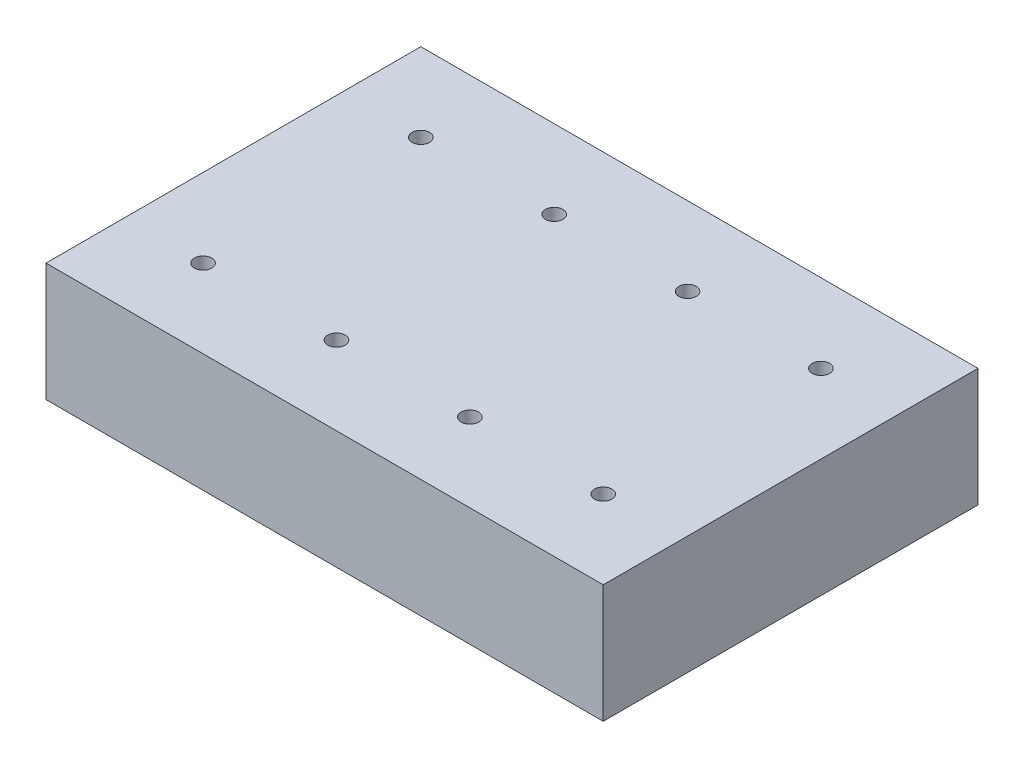
ISO-10303-21;
HEADER;
FILE_DESCRIPTION(('STEP AP214'),'2;1');
FILE_NAME('part.step','',(''),(''),'','','');
FILE_SCHEMA(('AUTOMOTIVE_DESIGN { 1 0 10303 214 1 1 1 1 }'));
ENDSEC;
DATA;
#1=APPLICATION_CONTEXT('core data for automotive mechanical design processes');
#2=APPLICATION_PROTOCOL_DEFINITION('international standard','automotive_design',2000,#1);
#3=PRODUCT_CONTEXT('',#1,'mechanical');
#4=PRODUCT('Part','Part','',(#3));
#5=PRODUCT_RELATED_PRODUCT_CATEGORY('part','',(#4));
#6=PRODUCT_DEFINITION_FORMATION('','',#4);
#7=PRODUCT_DEFINITION_CONTEXT('part definition',#1,'design');
#8=PRODUCT_DEFINITION('design','',#6,#7);
#9=PRODUCT_DEFINITION_SHAPE('','',#8);
#10=(LENGTH_UNIT() NAMED_UNIT(*) SI_UNIT(.MILLI.,.METRE.));
#11=(NAMED_UNIT(*) PLANE_ANGLE_UNIT() SI_UNIT($,.RADIAN.));
#12=(NAMED_UNIT(*) SI_UNIT($,.STERADIAN.) SOLID_ANGLE_UNIT());
#13=UNCERTAINTY_MEASURE_WITH_UNIT(LENGTH_MEASURE(1.E-05),#10,'distance_accuracy_value','');
#14=(GEOMETRIC_REPRESENTATION_CONTEXT(3) GLOBAL_UNCERTAINTY_ASSIGNED_CONTEXT((#13)) GLOBAL_UNIT_ASSIGNED_CONTEXT((#10,
#11,#12)) REPRESENTATION_CONTEXT('',''));
#15=CARTESIAN_POINT('',(0.,0.,0.));
#16=DIRECTION('',(0.,0.,1.));
#17=DIRECTION('',(1.,0.,0.));
#18=AXIS2_PLACEMENT_3D('',#15,#16,#17);
#19=CARTESIAN_POINT('',(-312.706003868978,28.1,-132.016665880732));
#20=DIRECTION('',(1.,0.,0.));
#21=DIRECTION('',(0.,0.,-1.));
#22=AXIS2_PLACEMENT_3D('',#19,#20,#21);
#23=PLANE('',#22);
#24=DIRECTION('',(0.,-1.,0.));
#25=VECTOR('',#24,1.);
#26=CARTESIAN_POINT('',(-312.706003868978,28.1,-132.016665880732));
#27=LINE('',#26,#25);
#28=CARTESIAN_POINT('',(-312.706003868978,28.1,-132.016665880732));
#29=VERTEX_POINT('',#28);
#30=CARTESIAN_POINT('',(-312.706003868978,1.,-132.016665880732));
#31=VERTEX_POINT('',#30);
#32=EDGE_CURVE('E315',#29,#31,#27,.T.);
#33=ORIENTED_EDGE('',*,*,#32,.T.);
#34=DIRECTION('',(0.,0.,1.));
#35=VECTOR('',#34,1.);
#36=CARTESIAN_POINT('',(-312.706003868978,1.,-132.016665880732));
#37=LINE('',#36,#35);
#38=CARTESIAN_POINT('',(-312.706003868978,1.,-46.1166658807324));
#39=VERTEX_POINT('',#38);
#40=EDGE_CURVE('E12',#31,#39,#37,.T.);
#41=ORIENTED_EDGE('',*,*,#40,.T.);
#42=DIRECTION('',(0.,-1.,0.));
#43=VECTOR('',#42,1.);
#44=CARTESIAN_POINT('',(-312.706003868978,28.1,-46.1166658807324));
#45=LINE('',#44,#43);
#46=CARTESIAN_POINT('',(-312.706003868978,28.1,-46.1166658807324));
#47=VERTEX_POINT('',#46);
#48=EDGE_CURVE('E152',#47,#39,#45,.T.);
#49=ORIENTED_EDGE('',*,*,#48,.F.);
#50=DIRECTION('',(0.,0.,1.));
#51=VECTOR('',#50,1.);
#52=CARTESIAN_POINT('',(-312.706003868978,28.1,-132.016665880732));
#53=LINE('',#52,#51);
#54=EDGE_CURVE('E158',#29,#47,#53,.T.);
#55=ORIENTED_EDGE('',*,*,#54,.F.);
#56=EDGE_LOOP('',(#33,#41,#49,#55));
#57=FACE_BOUND('',#56,.T.);
#58=ADVANCED_FACE('F95',(#57),#23,.F.);
#59=CARTESIAN_POINT('',(-312.706003868978,28.1,-46.1166658807324));
#60=DIRECTION('',(0.,0.,-1.));
#61=DIRECTION('',(-1.,0.,0.));
#62=AXIS2_PLACEMENT_3D('',#59,#60,#61);
#63=PLANE('',#62);
#64=ORIENTED_EDGE('',*,*,#48,.T.);
#65=DIRECTION('',(1.,0.,0.));
#66=VECTOR('',#65,1.);
#67=CARTESIAN_POINT('',(-312.706003868978,1.,-46.1166658807324));
#68=LINE('',#67,#66);
#69=CARTESIAN_POINT('',(-185.006003868978,1.,-46.1166658807324));
#70=VERTEX_POINT('',#69);
#71=EDGE_CURVE('E106',#39,#70,#68,.T.);
#72=ORIENTED_EDGE('',*,*,#71,.T.);
#73=DIRECTION('',(0.,-1.,0.));
#74=VECTOR('',#73,1.);
#75=CARTESIAN_POINT('',(-185.006003868978,28.1,-46.1166658807324));
#76=LINE('',#75,#74);
#77=CARTESIAN_POINT('',(-185.006003868978,28.1,-46.1166658807324));
#78=VERTEX_POINT('',#77);
#79=EDGE_CURVE('E153',#78,#70,#76,.T.);
#80=ORIENTED_EDGE('',*,*,#79,.F.);
#81=DIRECTION('',(1.,0.,0.));
#82=VECTOR('',#81,1.);
#83=CARTESIAN_POINT('',(-312.706003868978,28.1,-46.1166658807324));
#84=LINE('',#83,#82);
#85=EDGE_CURVE('E149',#47,#78,#84,.T.);
#86=ORIENTED_EDGE('',*,*,#85,.F.);
#87=EDGE_LOOP('',(#64,#72,#80,#86));
#88=FACE_BOUND('',#87,.T.);
#89=ADVANCED_FACE('F151',(#88),#63,.F.);
#90=CARTESIAN_POINT('',(-185.006003868978,28.1,-132.016665880732));
#91=DIRECTION('',(-1.,0.,0.));
#92=DIRECTION('',(0.,0.,1.));
#93=AXIS2_PLACEMENT_3D('',#90,#91,#92);
#94=PLANE('',#93);
#95=ORIENTED_EDGE('',*,*,#79,.T.);
#96=DIRECTION('',(0.,0.,-1.));
#97=VECTOR('',#96,1.);
#98=CARTESIAN_POINT('',(-185.006003868978,1.,-132.016665880732));
#99=LINE('',#98,#97);
#100=CARTESIAN_POINT('',(-185.006003868978,1.,-132.016665880732));
#101=VERTEX_POINT('',#100);
#102=EDGE_CURVE('E256',#70,#101,#99,.T.);
#103=ORIENTED_EDGE('',*,*,#102,.T.);
#104=DIRECTION('',(0.,-1.,0.));
#105=VECTOR('',#104,1.);
#106=CARTESIAN_POINT('',(-185.006003868978,28.1,-132.016665880732));
#107=LINE('',#106,#105);
#108=CARTESIAN_POINT('',(-185.006003868978,28.1,-132.016665880732));
#109=VERTEX_POINT('',#108);
#110=EDGE_CURVE('E176',#109,#101,#107,.T.);
#111=ORIENTED_EDGE('',*,*,#110,.F.);
#112=DIRECTION('',(0.,0.,-1.));
#113=VECTOR('',#112,1.);
#114=CARTESIAN_POINT('',(-185.006003868978,28.1,-132.016665880732));
#115=LINE('',#114,#113);
#116=EDGE_CURVE('E157',#78,#109,#115,.T.);
#117=ORIENTED_EDGE('',*,*,#116,.F.);
#118=EDGE_LOOP('',(#95,#103,#111,#117));
#119=FACE_BOUND('',#118,.T.);
#120=ADVANCED_FACE('F346',(#119),#94,.F.);
#121=CARTESIAN_POINT('',(-312.706003868978,28.1,-132.016665880732));
#122=DIRECTION('',(0.,0.,1.));
#123=DIRECTION('',(1.,0.,0.));
#124=AXIS2_PLACEMENT_3D('',#121,#122,#123);
#125=PLANE('',#124);
#126=ORIENTED_EDGE('',*,*,#110,.T.);
#127=DIRECTION('',(-1.,0.,0.));
#128=VECTOR('',#127,1.);
#129=CARTESIAN_POINT('',(-312.706003868978,1.,-132.016665880732));
#130=LINE('',#129,#128);
#131=EDGE_CURVE('E239',#101,#31,#130,.T.);
#132=ORIENTED_EDGE('',*,*,#131,.T.);
#133=ORIENTED_EDGE('',*,*,#32,.F.);
#134=DIRECTION('',(-1.,0.,0.));
#135=VECTOR('',#134,1.);
#136=CARTESIAN_POINT('',(-312.706003868978,28.1,-132.016665880732));
#137=LINE('',#136,#135);
#138=EDGE_CURVE('E163',#109,#29,#137,.T.);
#139=ORIENTED_EDGE('',*,*,#138,.F.);
#140=EDGE_LOOP('',(#126,#132,#133,#139));
#141=FACE_BOUND('',#140,.T.);
#142=ADVANCED_FACE('F322',(#141),#125,.F.);
#143=CARTESIAN_POINT('',(0.,28.1,0.));
#144=DIRECTION('',(0.,1.,0.));
#145=DIRECTION('',(0.,0.,1.));
#146=AXIS2_PLACEMENT_3D('',#143,#144,#145);
#147=PLANE('',#146);
#148=CARTESIAN_POINT('',(-294.706003868978,28.1,-114.016665880732));
#149=DIRECTION('',(0.,1.,0.));
#150=DIRECTION('',(0.,0.,1.));
#151=AXIS2_PLACEMENT_3D('',#148,#149,#150);
#152=CIRCLE('',#151,2.);
#153=CARTESIAN_POINT('',(-294.706003868978,28.1,-112.016665880732));
#154=VERTEX_POINT('',#153);
#155=EDGE_CURVE('E581',#154,#154,#152,.T.);
#156=ORIENTED_EDGE('',*,*,#155,.F.);
#157=EDGE_LOOP('',(#156));
#158=FACE_BOUND('',#157,.T.);
#159=CARTESIAN_POINT('',(-203.006003868978,28.1,-64.1166658807324));
#160=DIRECTION('',(0.,1.,0.));
#161=DIRECTION('',(0.,0.,1.));
#162=AXIS2_PLACEMENT_3D('',#159,#160,#161);
#163=CIRCLE('',#162,2.);
#164=CARTESIAN_POINT('',(-203.006003868978,28.1,-62.1166658807324));
#165=VERTEX_POINT('',#164);
#166=EDGE_CURVE('E561',#165,#165,#163,.T.);
#167=ORIENTED_EDGE('',*,*,#166,.F.);
#168=EDGE_LOOP('',(#167));
#169=FACE_BOUND('',#168,.T.);
#170=CARTESIAN_POINT('',(-233.566003868978,28.1,-64.1166658807324));
#171=DIRECTION('',(0.,1.,0.));
#172=DIRECTION('',(0.,0.,1.));
#173=AXIS2_PLACEMENT_3D('',#170,#171,#172);
#174=CIRCLE('',#173,2.);
#175=CARTESIAN_POINT('',(-233.566003868978,28.1,-62.1166658807324));
#176=VERTEX_POINT('',#175);
#177=EDGE_CURVE('E557',#176,#176,#174,.T.);
#178=ORIENTED_EDGE('',*,*,#177,.F.);
#179=EDGE_LOOP('',(#178));
#180=FACE_BOUND('',#179,.T.);
#181=CARTESIAN_POINT('',(-264.136003868978,28.1,-64.1166658807324));
#182=DIRECTION('',(0.,1.,0.));
#183=DIRECTION('',(0.,0.,1.));
#184=AXIS2_PLACEMENT_3D('',#181,#182,#183);
#185=CIRCLE('',#184,2.);
#186=CARTESIAN_POINT('',(-264.136003868978,28.1,-62.1166658807324));
#187=VERTEX_POINT('',#186);
#188=EDGE_CURVE('E265',#187,#187,#185,.T.);
#189=ORIENTED_EDGE('',*,*,#188,.F.);
#190=EDGE_LOOP('',(#189));
#191=FACE_BOUND('',#190,.T.);
#192=CARTESIAN_POINT('',(-264.136003868978,28.1,-114.016665880732));
#193=DIRECTION('',(0.,1.,0.));
#194=DIRECTION('',(0.,0.,1.));
#195=AXIS2_PLACEMENT_3D('',#192,#193,#194);
#196=CIRCLE('',#195,2.);
#197=CARTESIAN_POINT('',(-264.136003868978,28.1,-112.016665880732));
#198=VERTEX_POINT('',#197);
#199=EDGE_CURVE('E577',#198,#198,#196,.T.);
#200=ORIENTED_EDGE('',*,*,#199,.F.);
#201=EDGE_LOOP('',(#200));
#202=FACE_BOUND('',#201,.T.);
#203=CARTESIAN_POINT('',(-233.566003868978,28.1,-114.016665880732));
#204=DIRECTION('',(0.,1.,0.));
#205=DIRECTION('',(0.,0.,1.));
#206=AXIS2_PLACEMENT_3D('',#203,#204,#205);
#207=CIRCLE('',#206,2.);
#208=CARTESIAN_POINT('',(-233.566003868978,28.1,-112.016665880732));
#209=VERTEX_POINT('',#208);
#210=EDGE_CURVE('E569',#209,#209,#207,.T.);
#211=ORIENTED_EDGE('',*,*,#210,.F.);
#212=EDGE_LOOP('',(#211));
#213=FACE_BOUND('',#212,.T.);
#214=CARTESIAN_POINT('',(-203.006003868978,28.1,-114.016665880732));
#215=DIRECTION('',(0.,1.,0.));
#216=DIRECTION('',(0.,0.,1.));
#217=AXIS2_PLACEMENT_3D('',#214,#215,#216);
#218=CIRCLE('',#217,2.);
#219=CARTESIAN_POINT('',(-203.006003868978,28.1,-112.016665880732));
#220=VERTEX_POINT('',#219);
#221=EDGE_CURVE('E573',#220,#220,#218,.T.);
#222=ORIENTED_EDGE('',*,*,#221,.F.);
#223=EDGE_LOOP('',(#222));
#224=FACE_BOUND('',#223,.T.);
#225=CARTESIAN_POINT('',(-294.706003868978,28.1,-64.1166658807324));
#226=DIRECTION('',(0.,1.,0.));
#227=DIRECTION('',(0.,0.,1.));
#228=AXIS2_PLACEMENT_3D('',#225,#226,#227);
#229=CIRCLE('',#228,2.);
#230=CARTESIAN_POINT('',(-294.706003868978,28.1,-62.1166658807324));
#231=VERTEX_POINT('',#230);
#232=EDGE_CURVE('E565',#231,#231,#229,.T.);
#233=ORIENTED_EDGE('',*,*,#232,.F.);
#234=EDGE_LOOP('',(#233));
#235=FACE_BOUND('',#234,.T.);
#236=ORIENTED_EDGE('',*,*,#54,.T.);
#237=ORIENTED_EDGE('',*,*,#85,.T.);
#238=ORIENTED_EDGE('',*,*,#116,.T.);
#239=ORIENTED_EDGE('',*,*,#138,.T.);
#240=EDGE_LOOP('',(#236,#237,#238,#239));
#241=FACE_BOUND('',#240,.T.);
#242=ADVANCED_FACE('F161',(#158,#169,#180,#191,#202,#213,#224,#235,#241),#147,.T.);
#243=CARTESIAN_POINT('',(0.,0.,0.));
#244=DIRECTION('',(0.,1.,0.));
#245=DIRECTION('',(0.,0.,1.));
#246=AXIS2_PLACEMENT_3D('',#243,#244,#245);
#247=PLANE('',#246);
#248=DIRECTION('',(0.,0.,-1.));
#249=VECTOR('',#248,1.);
#250=CARTESIAN_POINT('',(-311.706003868978,0.,0.));
#251=LINE('',#250,#249);
#252=CARTESIAN_POINT('',(-311.706003868978,0.,-47.1166658807324));
#253=VERTEX_POINT('',#252);
#254=CARTESIAN_POINT('',(-311.706003868978,0.,-131.016665880732));
#255=VERTEX_POINT('',#254);
#256=EDGE_CURVE('E243',#253,#255,#251,.T.);
#257=ORIENTED_EDGE('',*,*,#256,.T.);
#258=DIRECTION('',(1.,0.,0.));
#259=VECTOR('',#258,1.);
#260=CARTESIAN_POINT('',(0.,0.,-131.016665880732));
#261=LINE('',#260,#259);
#262=CARTESIAN_POINT('',(-186.006003868978,0.,-131.016665880732));
#263=VERTEX_POINT('',#262);
#264=EDGE_CURVE('E252',#255,#263,#261,.T.);
#265=ORIENTED_EDGE('',*,*,#264,.T.);
#266=DIRECTION('',(0.,0.,1.));
#267=VECTOR('',#266,1.);
#268=CARTESIAN_POINT('',(-186.006003868977,0.,0.));
#269=LINE('',#268,#267);
#270=CARTESIAN_POINT('',(-186.006003868978,0.,-47.1166658807324));
#271=VERTEX_POINT('',#270);
#272=EDGE_CURVE('E249',#263,#271,#269,.T.);
#273=ORIENTED_EDGE('',*,*,#272,.T.);
#274=DIRECTION('',(-1.,0.,0.));
#275=VECTOR('',#274,1.);
#276=CARTESIAN_POINT('',(0.,0.,-47.1166658807323));
#277=LINE('',#276,#275);
#278=EDGE_CURVE('E246',#271,#253,#277,.T.);
#279=ORIENTED_EDGE('',*,*,#278,.T.);
#280=EDGE_LOOP('',(#257,#265,#273,#279));
#281=FACE_BOUND('',#280,.T.);
#282=CARTESIAN_POINT('',(-203.006003868978,0.,-114.016665880732));
#283=DIRECTION('',(0.,1.,0.));
#284=DIRECTION('',(0.,0.,1.));
#285=AXIS2_PLACEMENT_3D('',#282,#283,#284);
#286=CIRCLE('',#285,14.9);
#287=CARTESIAN_POINT('',(-203.006003868978,0.,-99.1166658807324));
#288=VERTEX_POINT('',#287);
#289=EDGE_CURVE('E223',#288,#288,#286,.T.);
#290=ORIENTED_EDGE('',*,*,#289,.T.);
#291=EDGE_LOOP('',(#290));
#292=FACE_BOUND('',#291,.T.);
#293=CARTESIAN_POINT('',(-233.566003868978,0.,-114.016665880732));
#294=DIRECTION('',(0.,1.,0.));
#295=DIRECTION('',(0.,0.,1.));
#296=AXIS2_PLACEMENT_3D('',#293,#294,#295);
#297=CIRCLE('',#296,14.9);
#298=CARTESIAN_POINT('',(-233.566003868978,0.,-99.1166658807324));
#299=VERTEX_POINT('',#298);
#300=EDGE_CURVE('E219',#299,#299,#297,.T.);
#301=ORIENTED_EDGE('',*,*,#300,.T.);
#302=EDGE_LOOP('',(#301));
#303=FACE_BOUND('',#302,.T.);
#304=CARTESIAN_POINT('',(-294.706003868978,0.,-114.016665880732));
#305=DIRECTION('',(0.,1.,0.));
#306=DIRECTION('',(0.,0.,1.));
#307=AXIS2_PLACEMENT_3D('',#304,#305,#306);
#308=CIRCLE('',#307,14.9);
#309=CARTESIAN_POINT('',(-294.706003868978,0.,-99.1166658807323));
#310=VERTEX_POINT('',#309);
#311=EDGE_CURVE('E215',#310,#310,#308,.T.);
#312=ORIENTED_EDGE('',*,*,#311,.T.);
#313=EDGE_LOOP('',(#312));
#314=FACE_BOUND('',#313,.T.);
#315=CARTESIAN_POINT('',(-264.136003868978,0.,-114.016665880732));
#316=DIRECTION('',(0.,1.,0.));
#317=DIRECTION('',(0.,0.,1.));
#318=AXIS2_PLACEMENT_3D('',#315,#316,#317);
#319=CIRCLE('',#318,14.9);
#320=CARTESIAN_POINT('',(-264.136003868978,0.,-99.1166658807324));
#321=VERTEX_POINT('',#320);
#322=EDGE_CURVE('E211',#321,#321,#319,.T.);
#323=ORIENTED_EDGE('',*,*,#322,.T.);
#324=EDGE_LOOP('',(#323));
#325=FACE_BOUND('',#324,.T.);
#326=CARTESIAN_POINT('',(-203.006003868978,0.,-64.1166658807324));
#327=DIRECTION('',(0.,1.,0.));
#328=DIRECTION('',(0.,0.,1.));
#329=AXIS2_PLACEMENT_3D('',#326,#327,#328);
#330=CIRCLE('',#329,14.9000000000001);
#331=CARTESIAN_POINT('',(-203.006003868978,0.,-49.2166658807323));
#332=VERTEX_POINT('',#331);
#333=EDGE_CURVE('E195',#332,#332,#330,.T.);
#334=ORIENTED_EDGE('',*,*,#333,.T.);
#335=EDGE_LOOP('',(#334));
#336=FACE_BOUND('',#335,.T.);
#337=CARTESIAN_POINT('',(-233.566003868978,0.,-64.1166658807324));
#338=DIRECTION('',(0.,1.,0.));
#339=DIRECTION('',(0.,0.,1.));
#340=AXIS2_PLACEMENT_3D('',#337,#338,#339);
#341=CIRCLE('',#340,14.9000000000001);
#342=CARTESIAN_POINT('',(-233.566003868978,0.,-49.2166658807323));
#343=VERTEX_POINT('',#342);
#344=EDGE_CURVE('E191',#343,#343,#341,.T.);
#345=ORIENTED_EDGE('',*,*,#344,.T.);
#346=EDGE_LOOP('',(#345));
#347=FACE_BOUND('',#346,.T.);
#348=CARTESIAN_POINT('',(-294.706003868978,0.,-64.1166658807324));
#349=DIRECTION('',(0.,1.,0.));
#350=DIRECTION('',(0.,0.,1.));
#351=AXIS2_PLACEMENT_3D('',#348,#349,#350);
#352=CIRCLE('',#351,14.9000000000001);
#353=CARTESIAN_POINT('',(-294.706003868978,0.,-49.2166658807323));
#354=VERTEX_POINT('',#353);
#355=EDGE_CURVE('E187',#354,#354,#352,.T.);
#356=ORIENTED_EDGE('',*,*,#355,.T.);
#357=EDGE_LOOP('',(#356));
#358=FACE_BOUND('',#357,.T.);
#359=CARTESIAN_POINT('',(-264.136003868978,0.,-64.1166658807324));
#360=DIRECTION('',(0.,1.,0.));
#361=DIRECTION('',(0.,0.,1.));
#362=AXIS2_PLACEMENT_3D('',#359,#360,#361);
#363=CIRCLE('',#362,14.9000000000001);
#364=CARTESIAN_POINT('',(-264.136003868978,0.,-49.2166658807323));
#365=VERTEX_POINT('',#364);
#366=EDGE_CURVE('E174',#365,#365,#363,.T.);
#367=ORIENTED_EDGE('',*,*,#366,.T.);
#368=EDGE_LOOP('',(#367));
#369=FACE_BOUND('',#368,.T.);
#370=ADVANCED_FACE('F484',(#281,#292,#303,#314,#325,#336,#347,#358,#369),#247,.F.);
#371=CARTESIAN_POINT('',(-264.136003868978,25.,-64.1166658807324));
#372=DIRECTION('',(0.,-1.,0.));
#373=DIRECTION('',(0.,0.,-1.));
#374=AXIS2_PLACEMENT_3D('',#371,#372,#373);
#375=CYLINDRICAL_SURFACE('',#374,13.9);
#376=CARTESIAN_POINT('',(-264.136003868978,1.00000000000004,-64.1166658807324));
#377=DIRECTION('',(0.,1.,0.));
#378=DIRECTION('',(0.,0.,1.));
#379=AXIS2_PLACEMENT_3D('',#376,#377,#378);
#380=CIRCLE('',#379,13.9);
#381=CARTESIAN_POINT('',(-264.136003868978,1.00000000000004,-50.2166658807323));
#382=VERTEX_POINT('',#381);
#383=EDGE_CURVE('E169',#382,#382,#380,.F.);
#384=ORIENTED_EDGE('',*,*,#383,.T.);
#385=EDGE_LOOP('',(#384));
#386=FACE_BOUND('',#385,.T.);
#387=CARTESIAN_POINT('',(-264.136003868978,25.,-64.1166658807324));
#388=DIRECTION('',(0.,-1.,0.));
#389=DIRECTION('',(0.,0.,-1.));
#390=AXIS2_PLACEMENT_3D('',#387,#388,#389);
#391=CIRCLE('',#390,13.9);
#392=CARTESIAN_POINT('',(-264.136003868978,25.,-78.0166658807324));
#393=VERTEX_POINT('',#392);
#394=EDGE_CURVE('E296',#393,#393,#391,.T.);
#395=ORIENTED_EDGE('',*,*,#394,.F.);
#396=EDGE_LOOP('',(#395));
#397=FACE_BOUND('',#396,.T.);
#398=ADVANCED_FACE('F481',(#386,#397),#375,.F.);
#399=CARTESIAN_POINT('',(-264.136003868978,25.,-64.1166658807324));
#400=DIRECTION('',(0.,-1.,0.));
#401=DIRECTION('',(0.,0.,-1.));
#402=AXIS2_PLACEMENT_3D('',#399,#400,#401);
#403=PLANE('',#402);
#404=CARTESIAN_POINT('',(-264.136003868978,25.,-64.1166658807324));
#405=DIRECTION('',(0.,-1.,0.));
#406=DIRECTION('',(0.,0.,-1.));
#407=AXIS2_PLACEMENT_3D('',#404,#405,#406);
#408=CIRCLE('',#407,2.);
#409=CARTESIAN_POINT('',(-264.136003868978,25.,-66.1166658807324));
#410=VERTEX_POINT('',#409);
#411=EDGE_CURVE('E589',#410,#410,#408,.T.);
#412=ORIENTED_EDGE('',*,*,#411,.F.);
#413=EDGE_LOOP('',(#412));
#414=FACE_BOUND('',#413,.T.);
#415=ORIENTED_EDGE('',*,*,#394,.T.);
#416=EDGE_LOOP('',(#415));
#417=FACE_BOUND('',#416,.T.);
#418=ADVANCED_FACE('F476',(#414,#417),#403,.T.);
#419=CARTESIAN_POINT('',(-233.566003868978,25.,-64.1166658807324));
#420=DIRECTION('',(0.,-1.,0.));
#421=DIRECTION('',(0.,0.,-1.));
#422=AXIS2_PLACEMENT_3D('',#419,#420,#421);
#423=CYLINDRICAL_SURFACE('',#422,13.9);
#424=CARTESIAN_POINT('',(-233.566003868978,1.00000000000004,-64.1166658807324));
#425=DIRECTION('',(0.,1.,0.));
#426=DIRECTION('',(0.,0.,1.));
#427=AXIS2_PLACEMENT_3D('',#424,#425,#426);
#428=CIRCLE('',#427,13.9);
#429=CARTESIAN_POINT('',(-233.566003868978,1.00000000000004,-50.2166658807323));
#430=VERTEX_POINT('',#429);
#431=EDGE_CURVE('E199',#430,#430,#428,.F.);
#432=ORIENTED_EDGE('',*,*,#431,.T.);
#433=EDGE_LOOP('',(#432));
#434=FACE_BOUND('',#433,.T.);
#435=CARTESIAN_POINT('',(-233.566003868978,25.,-64.1166658807324));
#436=DIRECTION('',(0.,-1.,0.));
#437=DIRECTION('',(0.,0.,-1.));
#438=AXIS2_PLACEMENT_3D('',#435,#436,#437);
#439=CIRCLE('',#438,13.9);
#440=CARTESIAN_POINT('',(-233.566003868978,25.,-78.0166658807324));
#441=VERTEX_POINT('',#440);
#442=EDGE_CURVE('E304',#441,#441,#439,.T.);
#443=ORIENTED_EDGE('',*,*,#442,.F.);
#444=EDGE_LOOP('',(#443));
#445=FACE_BOUND('',#444,.T.);
#446=ADVANCED_FACE('F473',(#434,#445),#423,.F.);
#447=CARTESIAN_POINT('',(-233.566003868978,25.,-64.1166658807324));
#448=DIRECTION('',(0.,-1.,0.));
#449=DIRECTION('',(0.,0.,-1.));
#450=AXIS2_PLACEMENT_3D('',#447,#448,#449);
#451=PLANE('',#450);
#452=CARTESIAN_POINT('',(-233.566003868978,25.,-64.1166658807324));
#453=DIRECTION('',(0.,-1.,0.));
#454=DIRECTION('',(0.,0.,-1.));
#455=AXIS2_PLACEMENT_3D('',#452,#453,#454);
#456=CIRCLE('',#455,2.);
#457=CARTESIAN_POINT('',(-233.566003868978,25.,-66.1166658807324));
#458=VERTEX_POINT('',#457);
#459=EDGE_CURVE('E590',#458,#458,#456,.T.);
#460=ORIENTED_EDGE('',*,*,#459,.F.);
#461=EDGE_LOOP('',(#460));
#462=FACE_BOUND('',#461,.T.);
#463=ORIENTED_EDGE('',*,*,#442,.T.);
#464=EDGE_LOOP('',(#463));
#465=FACE_BOUND('',#464,.T.);
#466=ADVANCED_FACE('F468',(#462,#465),#451,.T.);
#467=CARTESIAN_POINT('',(-203.006003868978,25.,-64.1166658807324));
#468=DIRECTION('',(0.,-1.,0.));
#469=DIRECTION('',(0.,0.,-1.));
#470=AXIS2_PLACEMENT_3D('',#467,#468,#469);
#471=CYLINDRICAL_SURFACE('',#470,13.9);
#472=CARTESIAN_POINT('',(-203.006003868978,1.00000000000004,-64.1166658807324));
#473=DIRECTION('',(0.,1.,0.));
#474=DIRECTION('',(0.,0.,1.));
#475=AXIS2_PLACEMENT_3D('',#472,#473,#474);
#476=CIRCLE('',#475,13.9);
#477=CARTESIAN_POINT('',(-203.006003868978,1.00000000000004,-50.2166658807323));
#478=VERTEX_POINT('',#477);
#479=EDGE_CURVE('E183',#478,#478,#476,.F.);
#480=ORIENTED_EDGE('',*,*,#479,.T.);
#481=EDGE_LOOP('',(#480));
#482=FACE_BOUND('',#481,.T.);
#483=CARTESIAN_POINT('',(-203.006003868978,25.,-64.1166658807324));
#484=DIRECTION('',(0.,-1.,0.));
#485=DIRECTION('',(0.,0.,-1.));
#486=AXIS2_PLACEMENT_3D('',#483,#484,#485);
#487=CIRCLE('',#486,13.9);
#488=CARTESIAN_POINT('',(-203.006003868978,25.,-78.0166658807324));
#489=VERTEX_POINT('',#488);
#490=EDGE_CURVE('E300',#489,#489,#487,.T.);
#491=ORIENTED_EDGE('',*,*,#490,.F.);
#492=EDGE_LOOP('',(#491));
#493=FACE_BOUND('',#492,.T.);
#494=ADVANCED_FACE('F465',(#482,#493),#471,.F.);
#495=CARTESIAN_POINT('',(-203.006003868978,25.,-64.1166658807324));
#496=DIRECTION('',(0.,-1.,0.));
#497=DIRECTION('',(0.,0.,-1.));
#498=AXIS2_PLACEMENT_3D('',#495,#496,#497);
#499=PLANE('',#498);
#500=CARTESIAN_POINT('',(-203.006003868978,25.,-64.1166658807324));
#501=DIRECTION('',(0.,-1.,0.));
#502=DIRECTION('',(0.,0.,-1.));
#503=AXIS2_PLACEMENT_3D('',#500,#501,#502);
#504=CIRCLE('',#503,2.);
#505=CARTESIAN_POINT('',(-203.006003868978,25.,-66.1166658807324));
#506=VERTEX_POINT('',#505);
#507=EDGE_CURVE('E594',#506,#506,#504,.T.);
#508=ORIENTED_EDGE('',*,*,#507,.F.);
#509=EDGE_LOOP('',(#508));
#510=FACE_BOUND('',#509,.T.);
#511=ORIENTED_EDGE('',*,*,#490,.T.);
#512=EDGE_LOOP('',(#511));
#513=FACE_BOUND('',#512,.T.);
#514=ADVANCED_FACE('F463',(#510,#513),#499,.T.);
#515=CARTESIAN_POINT('',(-294.706003868978,25.,-64.1166658807324));
#516=DIRECTION('',(0.,-1.,0.));
#517=DIRECTION('',(0.,0.,-1.));
#518=AXIS2_PLACEMENT_3D('',#515,#516,#517);
#519=CYLINDRICAL_SURFACE('',#518,13.9);
#520=CARTESIAN_POINT('',(-294.706003868978,1.00000000000004,-64.1166658807324));
#521=DIRECTION('',(0.,1.,0.));
#522=DIRECTION('',(0.,0.,1.));
#523=AXIS2_PLACEMENT_3D('',#520,#521,#522);
#524=CIRCLE('',#523,13.9);
#525=CARTESIAN_POINT('',(-294.706003868978,1.00000000000004,-50.2166658807323));
#526=VERTEX_POINT('',#525);
#527=EDGE_CURVE('E203',#526,#526,#524,.F.);
#528=ORIENTED_EDGE('',*,*,#527,.T.);
#529=EDGE_LOOP('',(#528));
#530=FACE_BOUND('',#529,.T.);
#531=CARTESIAN_POINT('',(-294.706003868978,25.,-64.1166658807324));
#532=DIRECTION('',(0.,-1.,0.));
#533=DIRECTION('',(0.,0.,-1.));
#534=AXIS2_PLACEMENT_3D('',#531,#532,#533);
#535=CIRCLE('',#534,13.9);
#536=CARTESIAN_POINT('',(-294.706003868978,25.,-78.0166658807324));
#537=VERTEX_POINT('',#536);
#538=EDGE_CURVE('E166',#537,#537,#535,.T.);
#539=ORIENTED_EDGE('',*,*,#538,.F.);
#540=EDGE_LOOP('',(#539));
#541=FACE_BOUND('',#540,.T.);
#542=ADVANCED_FACE('F459',(#530,#541),#519,.F.);
#543=CARTESIAN_POINT('',(-294.706003868978,25.,-64.1166658807324));
#544=DIRECTION('',(0.,-1.,0.));
#545=DIRECTION('',(0.,0.,-1.));
#546=AXIS2_PLACEMENT_3D('',#543,#544,#545);
#547=PLANE('',#546);
#548=CARTESIAN_POINT('',(-294.706003868978,25.,-64.1166658807324));
#549=DIRECTION('',(0.,-1.,0.));
#550=DIRECTION('',(0.,0.,-1.));
#551=AXIS2_PLACEMENT_3D('',#548,#549,#550);
#552=CIRCLE('',#551,2.);
#553=CARTESIAN_POINT('',(-294.706003868978,25.,-66.1166658807324));
#554=VERTEX_POINT('',#553);
#555=EDGE_CURVE('E585',#554,#554,#552,.T.);
#556=ORIENTED_EDGE('',*,*,#555,.F.);
#557=EDGE_LOOP('',(#556));
#558=FACE_BOUND('',#557,.T.);
#559=ORIENTED_EDGE('',*,*,#538,.T.);
#560=EDGE_LOOP('',(#559));
#561=FACE_BOUND('',#560,.T.);
#562=ADVANCED_FACE('F358',(#558,#561),#547,.T.);
#563=CARTESIAN_POINT('',(-264.136003868978,1.00000000000004,-64.1166658807324));
#564=DIRECTION('',(0.,-1.,0.));
#565=DIRECTION('',(0.,0.,-1.));
#566=AXIS2_PLACEMENT_3D('',#563,#564,#565);
#567=CONICAL_SURFACE('',#566,13.9,0.785398163397438);
#568=ORIENTED_EDGE('',*,*,#366,.F.);
#569=EDGE_LOOP('',(#568));
#570=FACE_BOUND('',#569,.T.);
#571=ORIENTED_EDGE('',*,*,#383,.F.);
#572=EDGE_LOOP('',(#571));
#573=FACE_BOUND('',#572,.T.);
#574=ADVANCED_FACE('F351',(#570,#573),#567,.F.);
#575=CARTESIAN_POINT('',(-203.006003868978,1.00000000000004,-64.1166658807324));
#576=DIRECTION('',(0.,-1.,0.));
#577=DIRECTION('',(0.,0.,-1.));
#578=AXIS2_PLACEMENT_3D('',#575,#576,#577);
#579=CONICAL_SURFACE('',#578,13.9,0.785398163397438);
#580=ORIENTED_EDGE('',*,*,#333,.F.);
#581=EDGE_LOOP('',(#580));
#582=FACE_BOUND('',#581,.T.);
#583=ORIENTED_EDGE('',*,*,#479,.F.);
#584=EDGE_LOOP('',(#583));
#585=FACE_BOUND('',#584,.T.);
#586=ADVANCED_FACE('F357',(#582,#585),#579,.F.);
#587=CARTESIAN_POINT('',(-233.566003868978,1.00000000000004,-64.1166658807324));
#588=DIRECTION('',(0.,-1.,0.));
#589=DIRECTION('',(0.,0.,-1.));
#590=AXIS2_PLACEMENT_3D('',#587,#588,#589);
#591=CONICAL_SURFACE('',#590,13.9,0.785398163397438);
#592=ORIENTED_EDGE('',*,*,#344,.F.);
#593=EDGE_LOOP('',(#592));
#594=FACE_BOUND('',#593,.T.);
#595=ORIENTED_EDGE('',*,*,#431,.F.);
#596=EDGE_LOOP('',(#595));
#597=FACE_BOUND('',#596,.T.);
#598=ADVANCED_FACE('F365',(#594,#597),#591,.F.);
#599=CARTESIAN_POINT('',(-294.706003868978,1.00000000000004,-64.1166658807324));
#600=DIRECTION('',(0.,-1.,0.));
#601=DIRECTION('',(0.,0.,-1.));
#602=AXIS2_PLACEMENT_3D('',#599,#600,#601);
#603=CONICAL_SURFACE('',#602,13.9,0.785398163397438);
#604=ORIENTED_EDGE('',*,*,#355,.F.);
#605=EDGE_LOOP('',(#604));
#606=FACE_BOUND('',#605,.T.);
#607=ORIENTED_EDGE('',*,*,#527,.F.);
#608=EDGE_LOOP('',(#607));
#609=FACE_BOUND('',#608,.T.);
#610=ADVANCED_FACE('F372',(#606,#609),#603,.F.);
#611=CARTESIAN_POINT('',(-233.566003868978,25.,-114.016665880732));
#612=DIRECTION('',(0.,-1.,0.));
#613=DIRECTION('',(0.,0.,-1.));
#614=AXIS2_PLACEMENT_3D('',#611,#612,#613);
#615=CYLINDRICAL_SURFACE('',#614,13.9);
#616=CARTESIAN_POINT('',(-233.566003868978,1.00000000000004,-114.016665880732));
#617=DIRECTION('',(0.,1.,0.));
#618=DIRECTION('',(0.,0.,1.));
#619=AXIS2_PLACEMENT_3D('',#616,#617,#618);
#620=CIRCLE('',#619,13.9);
#621=CARTESIAN_POINT('',(-233.566003868978,1.00000000000004,-100.116665880732));
#622=VERTEX_POINT('',#621);
#623=EDGE_CURVE('E227',#622,#622,#620,.F.);
#624=ORIENTED_EDGE('',*,*,#623,.T.);
#625=EDGE_LOOP('',(#624));
#626=FACE_BOUND('',#625,.T.);
#627=CARTESIAN_POINT('',(-233.566003868978,25.,-114.016665880732));
#628=DIRECTION('',(0.,-1.,0.));
#629=DIRECTION('',(0.,0.,-1.));
#630=AXIS2_PLACEMENT_3D('',#627,#628,#629);
#631=CIRCLE('',#630,13.9);
#632=CARTESIAN_POINT('',(-233.566003868978,25.,-127.916665880732));
#633=VERTEX_POINT('',#632);
#634=EDGE_CURVE('E292',#633,#633,#631,.T.);
#635=ORIENTED_EDGE('',*,*,#634,.F.);
#636=EDGE_LOOP('',(#635));
#637=FACE_BOUND('',#636,.T.);
#638=ADVANCED_FACE('F379',(#626,#637),#615,.F.);
#639=CARTESIAN_POINT('',(-233.566003868978,25.,-114.016665880732));
#640=DIRECTION('',(0.,-1.,0.));
#641=DIRECTION('',(0.,0.,-1.));
#642=AXIS2_PLACEMENT_3D('',#639,#640,#641);
#643=PLANE('',#642);
#644=CARTESIAN_POINT('',(-233.566003868978,25.,-114.016665880732));
#645=DIRECTION('',(0.,-1.,0.));
#646=DIRECTION('',(0.,0.,-1.));
#647=AXIS2_PLACEMENT_3D('',#644,#645,#646);
#648=CIRCLE('',#647,2.);
#649=CARTESIAN_POINT('',(-233.566003868978,25.,-116.016665880732));
#650=VERTEX_POINT('',#649);
#651=EDGE_CURVE('E610',#650,#650,#648,.T.);
#652=ORIENTED_EDGE('',*,*,#651,.F.);
#653=EDGE_LOOP('',(#652));
#654=FACE_BOUND('',#653,.T.);
#655=ORIENTED_EDGE('',*,*,#634,.T.);
#656=EDGE_LOOP('',(#655));
#657=FACE_BOUND('',#656,.T.);
#658=ADVANCED_FACE('F449',(#654,#657),#643,.T.);
#659=CARTESIAN_POINT('',(-203.006003868978,25.,-114.016665880732));
#660=DIRECTION('',(0.,-1.,0.));
#661=DIRECTION('',(0.,0.,-1.));
#662=AXIS2_PLACEMENT_3D('',#659,#660,#661);
#663=CYLINDRICAL_SURFACE('',#662,13.9);
#664=CARTESIAN_POINT('',(-203.006003868978,1.00000000000004,-114.016665880732));
#665=DIRECTION('',(0.,1.,0.));
#666=DIRECTION('',(0.,0.,1.));
#667=AXIS2_PLACEMENT_3D('',#664,#665,#666);
#668=CIRCLE('',#667,13.9);
#669=CARTESIAN_POINT('',(-203.006003868978,1.00000000000004,-100.116665880732));
#670=VERTEX_POINT('',#669);
#671=EDGE_CURVE('E207',#670,#670,#668,.F.);
#672=ORIENTED_EDGE('',*,*,#671,.T.);
#673=EDGE_LOOP('',(#672));
#674=FACE_BOUND('',#673,.T.);
#675=CARTESIAN_POINT('',(-203.006003868978,25.,-114.016665880732));
#676=DIRECTION('',(0.,-1.,0.));
#677=DIRECTION('',(0.,0.,-1.));
#678=AXIS2_PLACEMENT_3D('',#675,#676,#677);
#679=CIRCLE('',#678,13.9);
#680=CARTESIAN_POINT('',(-203.006003868978,25.,-127.916665880732));
#681=VERTEX_POINT('',#680);
#682=EDGE_CURVE('E288',#681,#681,#679,.T.);
#683=ORIENTED_EDGE('',*,*,#682,.F.);
#684=EDGE_LOOP('',(#683));
#685=FACE_BOUND('',#684,.T.);
#686=ADVANCED_FACE('F452',(#674,#685),#663,.F.);
#687=CARTESIAN_POINT('',(-203.006003868978,25.,-114.016665880732));
#688=DIRECTION('',(0.,-1.,0.));
#689=DIRECTION('',(0.,0.,-1.));
#690=AXIS2_PLACEMENT_3D('',#687,#688,#689);
#691=PLANE('',#690);
#692=CARTESIAN_POINT('',(-203.006003868978,25.,-114.016665880732));
#693=DIRECTION('',(0.,-1.,0.));
#694=DIRECTION('',(0.,0.,-1.));
#695=AXIS2_PLACEMENT_3D('',#692,#693,#694);
#696=CIRCLE('',#695,2.);
#697=CARTESIAN_POINT('',(-203.006003868978,25.,-116.016665880732));
#698=VERTEX_POINT('',#697);
#699=EDGE_CURVE('E606',#698,#698,#696,.T.);
#700=ORIENTED_EDGE('',*,*,#699,.F.);
#701=EDGE_LOOP('',(#700));
#702=FACE_BOUND('',#701,.T.);
#703=ORIENTED_EDGE('',*,*,#682,.T.);
#704=EDGE_LOOP('',(#703));
#705=FACE_BOUND('',#704,.T.);
#706=ADVANCED_FACE('F429',(#702,#705),#691,.T.);
#707=CARTESIAN_POINT('',(-264.136003868978,25.,-114.016665880732));
#708=DIRECTION('',(0.,-1.,0.));
#709=DIRECTION('',(0.,0.,-1.));
#710=AXIS2_PLACEMENT_3D('',#707,#708,#709);
#711=CYLINDRICAL_SURFACE('',#710,13.9);
#712=CARTESIAN_POINT('',(-264.136003868978,1.00000000000004,-114.016665880732));
#713=DIRECTION('',(0.,1.,0.));
#714=DIRECTION('',(0.,0.,1.));
#715=AXIS2_PLACEMENT_3D('',#712,#713,#714);
#716=CIRCLE('',#715,13.9);
#717=CARTESIAN_POINT('',(-264.136003868978,1.00000000000004,-100.116665880732));
#718=VERTEX_POINT('',#717);
#719=EDGE_CURVE('E235',#718,#718,#716,.F.);
#720=ORIENTED_EDGE('',*,*,#719,.T.);
#721=EDGE_LOOP('',(#720));
#722=FACE_BOUND('',#721,.T.);
#723=CARTESIAN_POINT('',(-264.136003868978,25.,-114.016665880732));
#724=DIRECTION('',(0.,-1.,0.));
#725=DIRECTION('',(0.,0.,-1.));
#726=AXIS2_PLACEMENT_3D('',#723,#724,#725);
#727=CIRCLE('',#726,13.9);
#728=CARTESIAN_POINT('',(-264.136003868978,25.,-127.916665880732));
#729=VERTEX_POINT('',#728);
#730=EDGE_CURVE('E282',#729,#729,#727,.T.);
#731=ORIENTED_EDGE('',*,*,#730,.F.);
#732=EDGE_LOOP('',(#731));
#733=FACE_BOUND('',#732,.T.);
#734=ADVANCED_FACE('F425',(#722,#733),#711,.F.);
#735=CARTESIAN_POINT('',(-264.136003868978,25.,-114.016665880732));
#736=DIRECTION('',(0.,-1.,0.));
#737=DIRECTION('',(0.,0.,-1.));
#738=AXIS2_PLACEMENT_3D('',#735,#736,#737);
#739=PLANE('',#738);
#740=CARTESIAN_POINT('',(-264.136003868978,25.,-114.016665880732));
#741=DIRECTION('',(0.,-1.,0.));
#742=DIRECTION('',(0.,0.,-1.));
#743=AXIS2_PLACEMENT_3D('',#740,#741,#742);
#744=CIRCLE('',#743,2.);
#745=CARTESIAN_POINT('',(-264.136003868978,25.,-116.016665880732));
#746=VERTEX_POINT('',#745);
#747=EDGE_CURVE('E602',#746,#746,#744,.T.);
#748=ORIENTED_EDGE('',*,*,#747,.F.);
#749=EDGE_LOOP('',(#748));
#750=FACE_BOUND('',#749,.T.);
#751=ORIENTED_EDGE('',*,*,#730,.T.);
#752=EDGE_LOOP('',(#751));
#753=FACE_BOUND('',#752,.T.);
#754=ADVANCED_FACE('F428',(#750,#753),#739,.T.);
#755=CARTESIAN_POINT('',(-294.706003868978,25.,-114.016665880732));
#756=DIRECTION('',(0.,-1.,0.));
#757=DIRECTION('',(0.,0.,-1.));
#758=AXIS2_PLACEMENT_3D('',#755,#756,#757);
#759=CYLINDRICAL_SURFACE('',#758,13.9);
#760=CARTESIAN_POINT('',(-294.706003868978,1.00000000000004,-114.016665880732));
#761=DIRECTION('',(0.,1.,0.));
#762=DIRECTION('',(0.,0.,1.));
#763=AXIS2_PLACEMENT_3D('',#760,#761,#762);
#764=CIRCLE('',#763,13.9);
#765=CARTESIAN_POINT('',(-294.706003868978,1.00000000000004,-100.116665880732));
#766=VERTEX_POINT('',#765);
#767=EDGE_CURVE('E231',#766,#766,#764,.F.);
#768=ORIENTED_EDGE('',*,*,#767,.T.);
#769=EDGE_LOOP('',(#768));
#770=FACE_BOUND('',#769,.T.);
#771=CARTESIAN_POINT('',(-294.706003868978,25.,-114.016665880732));
#772=DIRECTION('',(0.,-1.,0.));
#773=DIRECTION('',(0.,0.,-1.));
#774=AXIS2_PLACEMENT_3D('',#771,#772,#773);
#775=CIRCLE('',#774,13.9);
#776=CARTESIAN_POINT('',(-294.706003868978,25.,-127.916665880732));
#777=VERTEX_POINT('',#776);
#778=EDGE_CURVE('E275',#777,#777,#775,.T.);
#779=ORIENTED_EDGE('',*,*,#778,.F.);
#780=EDGE_LOOP('',(#779));
#781=FACE_BOUND('',#780,.T.);
#782=ADVANCED_FACE('F434',(#770,#781),#759,.F.);
#783=CARTESIAN_POINT('',(-294.706003868978,25.,-114.016665880732));
#784=DIRECTION('',(0.,-1.,0.));
#785=DIRECTION('',(0.,0.,-1.));
#786=AXIS2_PLACEMENT_3D('',#783,#784,#785);
#787=PLANE('',#786);
#788=CARTESIAN_POINT('',(-294.706003868978,25.,-114.016665880732));
#789=DIRECTION('',(0.,-1.,0.));
#790=DIRECTION('',(0.,0.,-1.));
#791=AXIS2_PLACEMENT_3D('',#788,#789,#790);
#792=CIRCLE('',#791,2.);
#793=CARTESIAN_POINT('',(-294.706003868978,25.,-116.016665880732));
#794=VERTEX_POINT('',#793);
#795=EDGE_CURVE('E598',#794,#794,#792,.T.);
#796=ORIENTED_EDGE('',*,*,#795,.F.);
#797=EDGE_LOOP('',(#796));
#798=FACE_BOUND('',#797,.T.);
#799=ORIENTED_EDGE('',*,*,#778,.T.);
#800=EDGE_LOOP('',(#799));
#801=FACE_BOUND('',#800,.T.);
#802=ADVANCED_FACE('F388',(#798,#801),#787,.T.);
#803=CARTESIAN_POINT('',(-203.006003868978,1.00000000000004,-114.016665880732));
#804=DIRECTION('',(0.,-1.,0.));
#805=DIRECTION('',(0.,0.,-1.));
#806=AXIS2_PLACEMENT_3D('',#803,#804,#805);
#807=CONICAL_SURFACE('',#806,13.9,0.785398163397438);
#808=ORIENTED_EDGE('',*,*,#289,.F.);
#809=EDGE_LOOP('',(#808));
#810=FACE_BOUND('',#809,.T.);
#811=ORIENTED_EDGE('',*,*,#671,.F.);
#812=EDGE_LOOP('',(#811));
#813=FACE_BOUND('',#812,.T.);
#814=ADVANCED_FACE('F381',(#810,#813),#807,.F.);
#815=CARTESIAN_POINT('',(-233.566003868978,1.00000000000004,-114.016665880732));
#816=DIRECTION('',(0.,-1.,0.));
#817=DIRECTION('',(0.,0.,-1.));
#818=AXIS2_PLACEMENT_3D('',#815,#816,#817);
#819=CONICAL_SURFACE('',#818,13.9,0.785398163397438);
#820=ORIENTED_EDGE('',*,*,#300,.F.);
#821=EDGE_LOOP('',(#820));
#822=FACE_BOUND('',#821,.T.);
#823=ORIENTED_EDGE('',*,*,#623,.F.);
#824=EDGE_LOOP('',(#823));
#825=FACE_BOUND('',#824,.T.);
#826=ADVANCED_FACE('F387',(#822,#825),#819,.F.);
#827=CARTESIAN_POINT('',(-294.706003868978,1.00000000000004,-114.016665880732));
#828=DIRECTION('',(0.,-1.,0.));
#829=DIRECTION('',(0.,0.,-1.));
#830=AXIS2_PLACEMENT_3D('',#827,#828,#829);
#831=CONICAL_SURFACE('',#830,13.9,0.785398163397438);
#832=ORIENTED_EDGE('',*,*,#311,.F.);
#833=EDGE_LOOP('',(#832));
#834=FACE_BOUND('',#833,.T.);
#835=ORIENTED_EDGE('',*,*,#767,.F.);
#836=EDGE_LOOP('',(#835));
#837=FACE_BOUND('',#836,.T.);
#838=ADVANCED_FACE('F395',(#834,#837),#831,.F.);
#839=CARTESIAN_POINT('',(-264.136003868978,1.00000000000004,-114.016665880732));
#840=DIRECTION('',(0.,-1.,0.));
#841=DIRECTION('',(0.,0.,-1.));
#842=AXIS2_PLACEMENT_3D('',#839,#840,#841);
#843=CONICAL_SURFACE('',#842,13.9,0.785398163397438);
#844=ORIENTED_EDGE('',*,*,#322,.F.);
#845=EDGE_LOOP('',(#844));
#846=FACE_BOUND('',#845,.T.);
#847=ORIENTED_EDGE('',*,*,#719,.F.);
#848=EDGE_LOOP('',(#847));
#849=FACE_BOUND('',#848,.T.);
#850=ADVANCED_FACE('F402',(#846,#849),#843,.F.);
#851=CARTESIAN_POINT('',(-312.706003868978,1.,-46.1166658807324));
#852=DIRECTION('',(0.,0.707106781186546,-0.707106781186549));
#853=DIRECTION('',(1.,0.,0.));
#854=AXIS2_PLACEMENT_3D('',#851,#852,#853);
#855=PLANE('',#854);
#856=DIRECTION('',(-0.577350269189627,0.577350269189627,0.577350269189624));
#857=VECTOR('',#856,1.);
#858=CARTESIAN_POINT('',(-284.072670535644,-27.6333333333333,-74.7499992140656));
#859=LINE('',#858,#857);
#860=EDGE_CURVE('E267',#253,#39,#859,.T.);
#861=ORIENTED_EDGE('',*,*,#860,.F.);
#862=ORIENTED_EDGE('',*,*,#278,.F.);
#863=DIRECTION('',(0.577350269189622,0.577350269189629,0.577350269189627));
#864=VECTOR('',#863,1.);
#865=CARTESIAN_POINT('',(-227.572670535644,-41.5666666666666,-88.6833325473988));
#866=LINE('',#865,#864);
#867=EDGE_CURVE('E100',#70,#271,#866,.F.);
#868=ORIENTED_EDGE('',*,*,#867,.F.);
#869=ORIENTED_EDGE('',*,*,#71,.F.);
#870=EDGE_LOOP('',(#861,#862,#868,#869));
#871=FACE_BOUND('',#870,.T.);
#872=ADVANCED_FACE('F98',(#871),#855,.F.);
#873=CARTESIAN_POINT('',(-185.006003868978,1.,-132.016665880732));
#874=DIRECTION('',(-0.707106781186552,0.707106781186543,0.));
#875=DIRECTION('',(0.,0.,-1.));
#876=AXIS2_PLACEMENT_3D('',#873,#874,#875);
#877=PLANE('',#876);
#878=ORIENTED_EDGE('',*,*,#867,.T.);
#879=ORIENTED_EDGE('',*,*,#272,.F.);
#880=DIRECTION('',(0.577350269189621,0.577350269189628,-0.577350269189628));
#881=VECTOR('',#880,1.);
#882=CARTESIAN_POINT('',(-185.006003868978,1.,-132.016665880732));
#883=LINE('',#882,#881);
#884=EDGE_CURVE('E264',#101,#263,#883,.F.);
#885=ORIENTED_EDGE('',*,*,#884,.F.);
#886=ORIENTED_EDGE('',*,*,#102,.F.);
#887=EDGE_LOOP('',(#878,#879,#885,#886));
#888=FACE_BOUND('',#887,.T.);
#889=ADVANCED_FACE('F325',(#888),#877,.F.);
#890=CARTESIAN_POINT('',(-312.706003868978,1.,-132.016665880732));
#891=DIRECTION('',(0.707106781186547,0.707106781186547,0.));
#892=DIRECTION('',(0.,0.,1.));
#893=AXIS2_PLACEMENT_3D('',#890,#891,#892);
#894=PLANE('',#893);
#895=ORIENTED_EDGE('',*,*,#860,.T.);
#896=ORIENTED_EDGE('',*,*,#40,.F.);
#897=DIRECTION('',(0.577350269189626,-0.577350269189626,0.577350269189626));
#898=VECTOR('',#897,1.);
#899=CARTESIAN_POINT('',(-312.706003868978,1.,-132.016665880732));
#900=LINE('',#899,#898);
#901=EDGE_CURVE('E261',#255,#31,#900,.F.);
#902=ORIENTED_EDGE('',*,*,#901,.F.);
#903=ORIENTED_EDGE('',*,*,#256,.F.);
#904=EDGE_LOOP('',(#895,#896,#902,#903));
#905=FACE_BOUND('',#904,.T.);
#906=ADVANCED_FACE('F330',(#905),#894,.F.);
#907=CARTESIAN_POINT('',(-312.706003868978,1.,-132.016665880732));
#908=DIRECTION('',(0.,0.707106781186547,0.707106781186547));
#909=DIRECTION('',(-1.,0.,0.));
#910=AXIS2_PLACEMENT_3D('',#907,#908,#909);
#911=PLANE('',#910);
#912=ORIENTED_EDGE('',*,*,#884,.T.);
#913=ORIENTED_EDGE('',*,*,#264,.F.);
#914=ORIENTED_EDGE('',*,*,#901,.T.);
#915=ORIENTED_EDGE('',*,*,#131,.F.);
#916=EDGE_LOOP('',(#912,#913,#914,#915));
#917=FACE_BOUND('',#916,.T.);
#918=ADVANCED_FACE('F328',(#917),#911,.F.);
#919=CARTESIAN_POINT('',(-294.706003868978,35.,-114.016665880732));
#920=DIRECTION('',(0.,-1.,0.));
#921=DIRECTION('',(0.,0.,-1.));
#922=AXIS2_PLACEMENT_3D('',#919,#920,#921);
#923=CYLINDRICAL_SURFACE('',#922,2.);
#924=ORIENTED_EDGE('',*,*,#155,.T.);
#925=EDGE_LOOP('',(#924));
#926=FACE_BOUND('',#925,.T.);
#927=ORIENTED_EDGE('',*,*,#795,.T.);
#928=EDGE_LOOP('',(#927));
#929=FACE_BOUND('',#928,.T.);
#930=ADVANCED_FACE('F337',(#926,#929),#923,.F.);
#931=CARTESIAN_POINT('',(-264.136003868978,35.,-114.016665880732));
#932=DIRECTION('',(0.,-1.,0.));
#933=DIRECTION('',(0.,0.,-1.));
#934=AXIS2_PLACEMENT_3D('',#931,#932,#933);
#935=CYLINDRICAL_SURFACE('',#934,2.);
#936=ORIENTED_EDGE('',*,*,#199,.T.);
#937=EDGE_LOOP('',(#936));
#938=FACE_BOUND('',#937,.T.);
#939=ORIENTED_EDGE('',*,*,#747,.T.);
#940=EDGE_LOOP('',(#939));
#941=FACE_BOUND('',#940,.T.);
#942=ADVANCED_FACE('F617',(#938,#941),#935,.F.);
#943=CARTESIAN_POINT('',(-203.006003868978,35.,-114.016665880732));
#944=DIRECTION('',(0.,-1.,0.));
#945=DIRECTION('',(0.,0.,-1.));
#946=AXIS2_PLACEMENT_3D('',#943,#944,#945);
#947=CYLINDRICAL_SURFACE('',#946,2.);
#948=ORIENTED_EDGE('',*,*,#221,.T.);
#949=EDGE_LOOP('',(#948));
#950=FACE_BOUND('',#949,.T.);
#951=ORIENTED_EDGE('',*,*,#699,.T.);
#952=EDGE_LOOP('',(#951));
#953=FACE_BOUND('',#952,.T.);
#954=ADVANCED_FACE('F619',(#950,#953),#947,.F.);
#955=CARTESIAN_POINT('',(-233.566003868978,35.,-114.016665880732));
#956=DIRECTION('',(0.,-1.,0.));
#957=DIRECTION('',(0.,0.,-1.));
#958=AXIS2_PLACEMENT_3D('',#955,#956,#957);
#959=CYLINDRICAL_SURFACE('',#958,2.);
#960=ORIENTED_EDGE('',*,*,#210,.T.);
#961=EDGE_LOOP('',(#960));
#962=FACE_BOUND('',#961,.T.);
#963=ORIENTED_EDGE('',*,*,#651,.T.);
#964=EDGE_LOOP('',(#963));
#965=FACE_BOUND('',#964,.T.);
#966=ADVANCED_FACE('F626',(#962,#965),#959,.F.);
#967=CARTESIAN_POINT('',(-294.706003868978,35.,-64.1166658807324));
#968=DIRECTION('',(0.,-1.,0.));
#969=DIRECTION('',(0.,0.,-1.));
#970=AXIS2_PLACEMENT_3D('',#967,#968,#969);
#971=CYLINDRICAL_SURFACE('',#970,2.);
#972=ORIENTED_EDGE('',*,*,#232,.T.);
#973=EDGE_LOOP('',(#972));
#974=FACE_BOUND('',#973,.T.);
#975=ORIENTED_EDGE('',*,*,#555,.T.);
#976=EDGE_LOOP('',(#975));
#977=FACE_BOUND('',#976,.T.);
#978=ADVANCED_FACE('F633',(#974,#977),#971,.F.);
#979=CARTESIAN_POINT('',(-203.006003868978,35.,-64.1166658807324));
#980=DIRECTION('',(0.,-1.,0.));
#981=DIRECTION('',(0.,0.,-1.));
#982=AXIS2_PLACEMENT_3D('',#979,#980,#981);
#983=CYLINDRICAL_SURFACE('',#982,2.);
#984=ORIENTED_EDGE('',*,*,#166,.T.);
#985=EDGE_LOOP('',(#984));
#986=FACE_BOUND('',#985,.T.);
#987=ORIENTED_EDGE('',*,*,#507,.T.);
#988=EDGE_LOOP('',(#987));
#989=FACE_BOUND('',#988,.T.);
#990=ADVANCED_FACE('F636',(#986,#989),#983,.F.);
#991=CARTESIAN_POINT('',(-233.566003868978,35.,-64.1166658807324));
#992=DIRECTION('',(0.,-1.,0.));
#993=DIRECTION('',(0.,0.,-1.));
#994=AXIS2_PLACEMENT_3D('',#991,#992,#993);
#995=CYLINDRICAL_SURFACE('',#994,2.);
#996=ORIENTED_EDGE('',*,*,#177,.T.);
#997=EDGE_LOOP('',(#996));
#998=FACE_BOUND('',#997,.T.);
#999=ORIENTED_EDGE('',*,*,#459,.T.);
#1000=EDGE_LOOP('',(#999));
#1001=FACE_BOUND('',#1000,.T.);
#1002=ADVANCED_FACE('F638',(#998,#1001),#995,.F.);
#1003=CARTESIAN_POINT('',(-264.136003868978,35.,-64.1166658807324));
#1004=DIRECTION('',(0.,-1.,0.));
#1005=DIRECTION('',(0.,0.,-1.));
#1006=AXIS2_PLACEMENT_3D('',#1003,#1004,#1005);
#1007=CYLINDRICAL_SURFACE('',#1006,2.);
#1008=ORIENTED_EDGE('',*,*,#188,.T.);
#1009=EDGE_LOOP('',(#1008));
#1010=FACE_BOUND('',#1009,.T.);
#1011=ORIENTED_EDGE('',*,*,#411,.T.);
#1012=EDGE_LOOP('',(#1011));
#1013=FACE_BOUND('',#1012,.T.);
#1014=ADVANCED_FACE('F641',(#1010,#1013),#1007,.F.);
#1015=CLOSED_SHELL('',(#58,#89,#120,#142,#242,#370,#398,#418,#446,#466,#494,#514,#542,#562,#574,
#586,#598,#610,#638,#658,#686,#706,#734,#754,#782,#802,#814,#826,#838,#850,#872,#889,#906,#918,
#930,#942,#954,#966,#978,#990,#1002,#1014));
#1016=MANIFOLD_SOLID_BREP('B2',#1015);
#1017=ADVANCED_BREP_SHAPE_REPRESENTATION('',(#18,#1016),#14);
#1018=SHAPE_DEFINITION_REPRESENTATION(#9,#1017);
ENDSEC;
END-ISO-10303-21;
